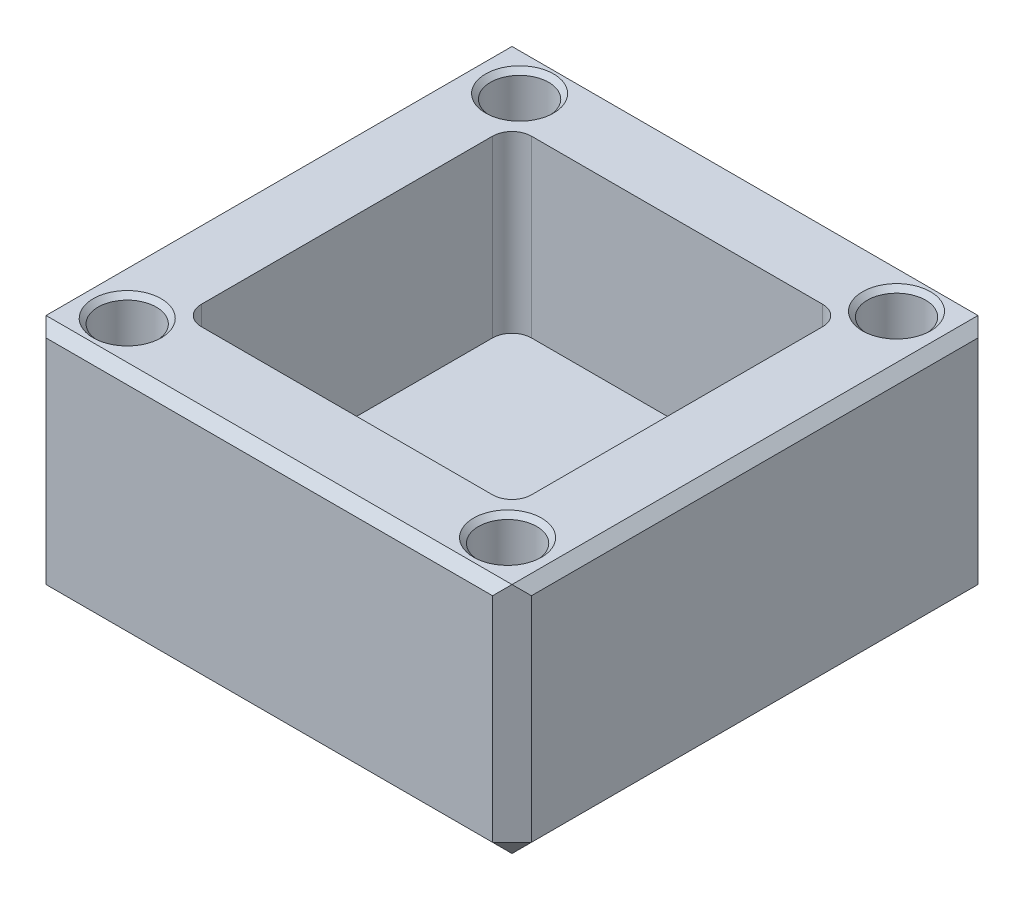
ISO-10303-21;
HEADER;
FILE_DESCRIPTION(('STEP AP214'),'2;1');
FILE_NAME('part.step','',(''),(''),'','','');
FILE_SCHEMA(('AUTOMOTIVE_DESIGN { 1 0 10303 214 1 1 1 1 }'));
ENDSEC;
DATA;
#1=APPLICATION_CONTEXT('core data for automotive mechanical design processes');
#2=APPLICATION_PROTOCOL_DEFINITION('international standard','automotive_design',2000,#1);
#3=PRODUCT_CONTEXT('',#1,'mechanical');
#4=PRODUCT('Part','Part','',(#3));
#5=PRODUCT_RELATED_PRODUCT_CATEGORY('part','',(#4));
#6=PRODUCT_DEFINITION_FORMATION('','',#4);
#7=PRODUCT_DEFINITION_CONTEXT('part definition',#1,'design');
#8=PRODUCT_DEFINITION('design','',#6,#7);
#9=PRODUCT_DEFINITION_SHAPE('','',#8);
#10=(LENGTH_UNIT() NAMED_UNIT(*) SI_UNIT(.MILLI.,.METRE.));
#11=(NAMED_UNIT(*) PLANE_ANGLE_UNIT() SI_UNIT($,.RADIAN.));
#12=(NAMED_UNIT(*) SI_UNIT($,.STERADIAN.) SOLID_ANGLE_UNIT());
#13=UNCERTAINTY_MEASURE_WITH_UNIT(LENGTH_MEASURE(1.E-05),#10,'distance_accuracy_value','');
#14=(GEOMETRIC_REPRESENTATION_CONTEXT(3) GLOBAL_UNCERTAINTY_ASSIGNED_CONTEXT((#13)) GLOBAL_UNIT_ASSIGNED_CONTEXT((#10,
#11,#12)) REPRESENTATION_CONTEXT('',''));
#15=CARTESIAN_POINT('',(0.,0.,0.));
#16=DIRECTION('',(0.,0.,1.));
#17=DIRECTION('',(1.,0.,0.));
#18=AXIS2_PLACEMENT_3D('',#15,#16,#17);
#19=CARTESIAN_POINT('',(25.,25.,-25.));
#20=DIRECTION('',(-1.,0.,0.));
#21=DIRECTION('',(0.,0.,1.));
#22=AXIS2_PLACEMENT_3D('',#19,#20,#21);
#23=PLANE('',#22);
#24=DIRECTION('',(0.,1.,0.));
#25=VECTOR('',#24,1.);
#26=CARTESIAN_POINT('',(25.,25.,-23.));
#27=LINE('',#26,#25);
#28=CARTESIAN_POINT('',(25.,2.,-23.));
#29=VERTEX_POINT('',#28);
#30=CARTESIAN_POINT('',(25.,24.,-23.));
#31=VERTEX_POINT('',#30);
#32=EDGE_CURVE('E199',#29,#31,#27,.T.);
#33=ORIENTED_EDGE('',*,*,#32,.T.);
#34=DIRECTION('',(0.,0.,1.));
#35=VECTOR('',#34,1.);
#36=CARTESIAN_POINT('',(25.,24.,23.));
#37=LINE('',#36,#35);
#38=CARTESIAN_POINT('',(25.,24.,23.));
#39=VERTEX_POINT('',#38);
#40=EDGE_CURVE('E310',#31,#39,#37,.T.);
#41=ORIENTED_EDGE('',*,*,#40,.T.);
#42=DIRECTION('',(0.,-1.,0.));
#43=VECTOR('',#42,1.);
#44=CARTESIAN_POINT('',(25.,25.,23.));
#45=LINE('',#44,#43);
#46=CARTESIAN_POINT('',(25.,2.,23.));
#47=VERTEX_POINT('',#46);
#48=EDGE_CURVE('E238',#39,#47,#45,.T.);
#49=ORIENTED_EDGE('',*,*,#48,.T.);
#50=DIRECTION('',(0.,0.,-1.));
#51=VECTOR('',#50,1.);
#52=CARTESIAN_POINT('',(25.,2.,-25.));
#53=LINE('',#52,#51);
#54=EDGE_CURVE('E240',#47,#29,#53,.T.);
#55=ORIENTED_EDGE('',*,*,#54,.T.);
#56=EDGE_LOOP('',(#33,#41,#49,#55));
#57=FACE_BOUND('',#56,.T.);
#58=ADVANCED_FACE('F40',(#57),#23,.F.);
#59=CARTESIAN_POINT('',(-25.,25.,-25.));
#60=DIRECTION('',(0.,0.,1.));
#61=DIRECTION('',(1.,0.,0.));
#62=AXIS2_PLACEMENT_3D('',#59,#60,#61);
#63=PLANE('',#62);
#64=DIRECTION('',(0.,1.,0.));
#65=VECTOR('',#64,1.);
#66=CARTESIAN_POINT('',(-23.,25.,-25.));
#67=LINE('',#66,#65);
#68=CARTESIAN_POINT('',(-23.,2.,-25.));
#69=VERTEX_POINT('',#68);
#70=CARTESIAN_POINT('',(-23.,24.,-25.));
#71=VERTEX_POINT('',#70);
#72=EDGE_CURVE('E217',#69,#71,#67,.T.);
#73=ORIENTED_EDGE('',*,*,#72,.T.);
#74=DIRECTION('',(1.,0.,0.));
#75=VECTOR('',#74,1.);
#76=CARTESIAN_POINT('',(23.,24.,-25.));
#77=LINE('',#76,#75);
#78=CARTESIAN_POINT('',(23.,24.,-25.));
#79=VERTEX_POINT('',#78);
#80=EDGE_CURVE('E187',#71,#79,#77,.T.);
#81=ORIENTED_EDGE('',*,*,#80,.T.);
#82=DIRECTION('',(0.,-1.,0.));
#83=VECTOR('',#82,1.);
#84=CARTESIAN_POINT('',(23.,25.,-25.));
#85=LINE('',#84,#83);
#86=CARTESIAN_POINT('',(23.,2.,-25.));
#87=VERTEX_POINT('',#86);
#88=EDGE_CURVE('E180',#79,#87,#85,.T.);
#89=ORIENTED_EDGE('',*,*,#88,.T.);
#90=DIRECTION('',(-1.,0.,0.));
#91=VECTOR('',#90,1.);
#92=CARTESIAN_POINT('',(-25.,2.,-25.));
#93=LINE('',#92,#91);
#94=EDGE_CURVE('E185',#87,#69,#93,.T.);
#95=ORIENTED_EDGE('',*,*,#94,.T.);
#96=EDGE_LOOP('',(#73,#81,#89,#95));
#97=FACE_BOUND('',#96,.T.);
#98=ADVANCED_FACE('F183',(#97),#63,.F.);
#99=CARTESIAN_POINT('',(-25.,25.,-25.));
#100=DIRECTION('',(1.,0.,0.));
#101=DIRECTION('',(0.,0.,-1.));
#102=AXIS2_PLACEMENT_3D('',#99,#100,#101);
#103=PLANE('',#102);
#104=DIRECTION('',(0.,1.,0.));
#105=VECTOR('',#104,1.);
#106=CARTESIAN_POINT('',(-25.,25.,23.));
#107=LINE('',#106,#105);
#108=CARTESIAN_POINT('',(-25.,2.,23.));
#109=VERTEX_POINT('',#108);
#110=CARTESIAN_POINT('',(-25.,24.,23.));
#111=VERTEX_POINT('',#110);
#112=EDGE_CURVE('E231',#109,#111,#107,.T.);
#113=ORIENTED_EDGE('',*,*,#112,.T.);
#114=DIRECTION('',(0.,0.,-1.));
#115=VECTOR('',#114,1.);
#116=CARTESIAN_POINT('',(-25.,24.,-23.));
#117=LINE('',#116,#115);
#118=CARTESIAN_POINT('',(-25.,24.,-23.));
#119=VERTEX_POINT('',#118);
#120=EDGE_CURVE('E291',#111,#119,#117,.T.);
#121=ORIENTED_EDGE('',*,*,#120,.T.);
#122=DIRECTION('',(0.,-1.,0.));
#123=VECTOR('',#122,1.);
#124=CARTESIAN_POINT('',(-25.,25.,-23.));
#125=LINE('',#124,#123);
#126=CARTESIAN_POINT('',(-25.,2.,-23.));
#127=VERTEX_POINT('',#126);
#128=EDGE_CURVE('E236',#119,#127,#125,.T.);
#129=ORIENTED_EDGE('',*,*,#128,.T.);
#130=DIRECTION('',(0.,0.,1.));
#131=VECTOR('',#130,1.);
#132=CARTESIAN_POINT('',(-25.,2.,-25.));
#133=LINE('',#132,#131);
#134=EDGE_CURVE('E234',#127,#109,#133,.T.);
#135=ORIENTED_EDGE('',*,*,#134,.T.);
#136=EDGE_LOOP('',(#113,#121,#129,#135));
#137=FACE_BOUND('',#136,.T.);
#138=ADVANCED_FACE('F388',(#137),#103,.F.);
#139=CARTESIAN_POINT('',(-25.,25.,25.));
#140=DIRECTION('',(0.,0.,-1.));
#141=DIRECTION('',(-1.,0.,0.));
#142=AXIS2_PLACEMENT_3D('',#139,#140,#141);
#143=PLANE('',#142);
#144=DIRECTION('',(0.,1.,0.));
#145=VECTOR('',#144,1.);
#146=CARTESIAN_POINT('',(23.,25.,25.));
#147=LINE('',#146,#145);
#148=CARTESIAN_POINT('',(23.,2.,25.));
#149=VERTEX_POINT('',#148);
#150=CARTESIAN_POINT('',(23.,24.,25.));
#151=VERTEX_POINT('',#150);
#152=EDGE_CURVE('E247',#149,#151,#147,.T.);
#153=ORIENTED_EDGE('',*,*,#152,.T.);
#154=DIRECTION('',(-1.,0.,0.));
#155=VECTOR('',#154,1.);
#156=CARTESIAN_POINT('',(-23.,24.,25.));
#157=LINE('',#156,#155);
#158=CARTESIAN_POINT('',(-23.,24.,25.));
#159=VERTEX_POINT('',#158);
#160=EDGE_CURVE('E308',#151,#159,#157,.T.);
#161=ORIENTED_EDGE('',*,*,#160,.T.);
#162=DIRECTION('',(0.,-1.,0.));
#163=VECTOR('',#162,1.);
#164=CARTESIAN_POINT('',(-23.,25.,25.));
#165=LINE('',#164,#163);
#166=CARTESIAN_POINT('',(-23.,2.,25.));
#167=VERTEX_POINT('',#166);
#168=EDGE_CURVE('E243',#159,#167,#165,.T.);
#169=ORIENTED_EDGE('',*,*,#168,.T.);
#170=DIRECTION('',(1.,0.,0.));
#171=VECTOR('',#170,1.);
#172=CARTESIAN_POINT('',(-25.,2.,25.));
#173=LINE('',#172,#171);
#174=EDGE_CURVE('E245',#167,#149,#173,.T.);
#175=ORIENTED_EDGE('',*,*,#174,.T.);
#176=EDGE_LOOP('',(#153,#161,#169,#175));
#177=FACE_BOUND('',#176,.T.);
#178=ADVANCED_FACE('F601',(#177),#143,.F.);
#179=CARTESIAN_POINT('',(0.,25.,0.));
#180=DIRECTION('',(0.,1.,0.));
#181=DIRECTION('',(0.,0.,1.));
#182=AXIS2_PLACEMENT_3D('',#179,#180,#181);
#183=PLANE('',#182);
#184=CARTESIAN_POINT('',(19.4340279778043,25.,-20.1741940399519));
#185=DIRECTION('',(0.,1.,0.));
#186=DIRECTION('',(0.,0.,1.));
#187=AXIS2_PLACEMENT_3D('',#184,#185,#186);
#188=CIRCLE('',#187,3.50000000000002);
#189=CARTESIAN_POINT('',(19.4340279778043,25.,-16.6741940399519));
#190=VERTEX_POINT('',#189);
#191=EDGE_CURVE('E357',#190,#190,#188,.F.);
#192=ORIENTED_EDGE('',*,*,#191,.T.);
#193=EDGE_LOOP('',(#192));
#194=FACE_BOUND('',#193,.T.);
#195=CARTESIAN_POINT('',(-19.4101736363355,25.,-20.1923444429938));
#196=DIRECTION('',(0.,1.,0.));
#197=DIRECTION('',(0.,0.,1.));
#198=AXIS2_PLACEMENT_3D('',#195,#196,#197);
#199=CIRCLE('',#198,3.50000000000002);
#200=CARTESIAN_POINT('',(-19.4101736363355,25.,-16.6923444429938));
#201=VERTEX_POINT('',#200);
#202=EDGE_CURVE('E354',#201,#201,#199,.F.);
#203=ORIENTED_EDGE('',*,*,#202,.T.);
#204=EDGE_LOOP('',(#203));
#205=FACE_BOUND('',#204,.T.);
#206=CARTESIAN_POINT('',(-19.5684293991816,25.,20.0664589384859));
#207=DIRECTION('',(0.,1.,0.));
#208=DIRECTION('',(0.,0.,1.));
#209=AXIS2_PLACEMENT_3D('',#206,#207,#208);
#210=CIRCLE('',#209,3.50000000000002);
#211=CARTESIAN_POINT('',(-19.5684293991816,25.,23.5664589384859));
#212=VERTEX_POINT('',#211);
#213=EDGE_CURVE('E351',#212,#212,#210,.F.);
#214=ORIENTED_EDGE('',*,*,#213,.T.);
#215=EDGE_LOOP('',(#214));
#216=FACE_BOUND('',#215,.T.);
#217=CARTESIAN_POINT('',(19.5918577536134,25.,20.046682357095));
#218=DIRECTION('',(0.,1.,0.));
#219=DIRECTION('',(0.,0.,1.));
#220=AXIS2_PLACEMENT_3D('',#217,#218,#219);
#221=CIRCLE('',#220,3.50000000000002);
#222=CARTESIAN_POINT('',(19.5918577536134,25.,23.5466823570951));
#223=VERTEX_POINT('',#222);
#224=EDGE_CURVE('E348',#223,#223,#221,.F.);
#225=ORIENTED_EDGE('',*,*,#224,.T.);
#226=EDGE_LOOP('',(#225));
#227=FACE_BOUND('',#226,.T.);
#228=DIRECTION('',(1.,0.,0.));
#229=VECTOR('',#228,1.);
#230=CARTESIAN_POINT('',(-17.,25.,17.));
#231=LINE('',#230,#229);
#232=CARTESIAN_POINT('',(-15.,25.,17.));
#233=VERTEX_POINT('',#232);
#234=CARTESIAN_POINT('',(15.,25.,17.));
#235=VERTEX_POINT('',#234);
#236=EDGE_CURVE('E563',#233,#235,#231,.T.);
#237=ORIENTED_EDGE('',*,*,#236,.F.);
#238=CARTESIAN_POINT('',(-15.,25.,15.));
#239=DIRECTION('',(0.,1.,0.));
#240=DIRECTION('',(0.,0.,1.));
#241=AXIS2_PLACEMENT_3D('',#238,#239,#240);
#242=CIRCLE('',#241,2.);
#243=CARTESIAN_POINT('',(-17.,25.,15.));
#244=VERTEX_POINT('',#243);
#245=EDGE_CURVE('E339',#233,#244,#242,.F.);
#246=ORIENTED_EDGE('',*,*,#245,.T.);
#247=DIRECTION('',(0.,0.,1.));
#248=VECTOR('',#247,1.);
#249=CARTESIAN_POINT('',(-17.,25.,-17.));
#250=LINE('',#249,#248);
#251=CARTESIAN_POINT('',(-17.,25.,-15.));
#252=VERTEX_POINT('',#251);
#253=EDGE_CURVE('E555',#252,#244,#250,.T.);
#254=ORIENTED_EDGE('',*,*,#253,.F.);
#255=CARTESIAN_POINT('',(-15.,25.,-15.));
#256=DIRECTION('',(0.,1.,0.));
#257=DIRECTION('',(0.,0.,1.));
#258=AXIS2_PLACEMENT_3D('',#255,#256,#257);
#259=CIRCLE('',#258,2.);
#260=CARTESIAN_POINT('',(-15.,25.,-17.));
#261=VERTEX_POINT('',#260);
#262=EDGE_CURVE('E64',#252,#261,#259,.F.);
#263=ORIENTED_EDGE('',*,*,#262,.T.);
#264=DIRECTION('',(1.,0.,0.));
#265=VECTOR('',#264,1.);
#266=CARTESIAN_POINT('',(-17.,25.,-17.));
#267=LINE('',#266,#265);
#268=CARTESIAN_POINT('',(15.,25.,-17.));
#269=VERTEX_POINT('',#268);
#270=EDGE_CURVE('E569',#261,#269,#267,.T.);
#271=ORIENTED_EDGE('',*,*,#270,.T.);
#272=CARTESIAN_POINT('',(15.,25.,-15.));
#273=DIRECTION('',(0.,1.,0.));
#274=DIRECTION('',(0.,0.,1.));
#275=AXIS2_PLACEMENT_3D('',#272,#273,#274);
#276=CIRCLE('',#275,2.);
#277=CARTESIAN_POINT('',(17.,25.,-15.));
#278=VERTEX_POINT('',#277);
#279=EDGE_CURVE('E56',#269,#278,#276,.F.);
#280=ORIENTED_EDGE('',*,*,#279,.T.);
#281=DIRECTION('',(0.,0.,1.));
#282=VECTOR('',#281,1.);
#283=CARTESIAN_POINT('',(17.,25.,-17.));
#284=LINE('',#283,#282);
#285=CARTESIAN_POINT('',(17.,25.,15.));
#286=VERTEX_POINT('',#285);
#287=EDGE_CURVE('E566',#278,#286,#284,.T.);
#288=ORIENTED_EDGE('',*,*,#287,.T.);
#289=CARTESIAN_POINT('',(15.,25.,15.));
#290=DIRECTION('',(0.,1.,0.));
#291=DIRECTION('',(0.,0.,1.));
#292=AXIS2_PLACEMENT_3D('',#289,#290,#291);
#293=CIRCLE('',#292,2.);
#294=EDGE_CURVE('E341',#286,#235,#293,.F.);
#295=ORIENTED_EDGE('',*,*,#294,.T.);
#296=EDGE_LOOP('',(#237,#246,#254,#263,#271,#280,#288,#295));
#297=FACE_BOUND('',#296,.T.);
#298=DIRECTION('',(-1.,0.,0.));
#299=VECTOR('',#298,1.);
#300=CARTESIAN_POINT('',(-23.,25.,-24.));
#301=LINE('',#300,#299);
#302=CARTESIAN_POINT('',(24.,25.,-24.));
#303=VERTEX_POINT('',#302);
#304=CARTESIAN_POINT('',(-24.,25.,-24.));
#305=VERTEX_POINT('',#304);
#306=EDGE_CURVE('E280',#303,#305,#301,.T.);
#307=ORIENTED_EDGE('',*,*,#306,.T.);
#308=DIRECTION('',(0.,0.,1.));
#309=VECTOR('',#308,1.);
#310=CARTESIAN_POINT('',(-24.,25.,23.));
#311=LINE('',#310,#309);
#312=CARTESIAN_POINT('',(-24.,25.,24.));
#313=VERTEX_POINT('',#312);
#314=EDGE_CURVE('E283',#305,#313,#311,.T.);
#315=ORIENTED_EDGE('',*,*,#314,.T.);
#316=DIRECTION('',(1.,0.,0.));
#317=VECTOR('',#316,1.);
#318=CARTESIAN_POINT('',(23.,25.,24.));
#319=LINE('',#318,#317);
#320=CARTESIAN_POINT('',(24.,25.,24.));
#321=VERTEX_POINT('',#320);
#322=EDGE_CURVE('E277',#313,#321,#319,.T.);
#323=ORIENTED_EDGE('',*,*,#322,.T.);
#324=DIRECTION('',(0.,0.,-1.));
#325=VECTOR('',#324,1.);
#326=CARTESIAN_POINT('',(24.,25.,-23.));
#327=LINE('',#326,#325);
#328=EDGE_CURVE('E250',#321,#303,#327,.T.);
#329=ORIENTED_EDGE('',*,*,#328,.T.);
#330=EDGE_LOOP('',(#307,#315,#323,#329));
#331=FACE_BOUND('',#330,.T.);
#332=ADVANCED_FACE('F597',(#194,#205,#216,#227,#297,#331),#183,.T.);
#333=CARTESIAN_POINT('',(0.,0.,0.));
#334=DIRECTION('',(0.,1.,0.));
#335=DIRECTION('',(0.,0.,1.));
#336=AXIS2_PLACEMENT_3D('',#333,#334,#335);
#337=PLANE('',#336);
#338=DIRECTION('',(0.,0.,-1.));
#339=VECTOR('',#338,1.);
#340=CARTESIAN_POINT('',(-23.,0.,0.));
#341=LINE('',#340,#339);
#342=CARTESIAN_POINT('',(-23.,0.,23.));
#343=VERTEX_POINT('',#342);
#344=CARTESIAN_POINT('',(-23.,0.,-23.));
#345=VERTEX_POINT('',#344);
#346=EDGE_CURVE('E226',#343,#345,#341,.T.);
#347=ORIENTED_EDGE('',*,*,#346,.T.);
#348=DIRECTION('',(1.,0.,0.));
#349=VECTOR('',#348,1.);
#350=CARTESIAN_POINT('',(0.,0.,-23.));
#351=LINE('',#350,#349);
#352=CARTESIAN_POINT('',(23.,0.,-23.));
#353=VERTEX_POINT('',#352);
#354=EDGE_CURVE('E228',#345,#353,#351,.T.);
#355=ORIENTED_EDGE('',*,*,#354,.T.);
#356=DIRECTION('',(0.,0.,1.));
#357=VECTOR('',#356,1.);
#358=CARTESIAN_POINT('',(23.,0.,0.));
#359=LINE('',#358,#357);
#360=CARTESIAN_POINT('',(23.,0.,23.));
#361=VERTEX_POINT('',#360);
#362=EDGE_CURVE('E224',#353,#361,#359,.T.);
#363=ORIENTED_EDGE('',*,*,#362,.T.);
#364=DIRECTION('',(-1.,0.,0.));
#365=VECTOR('',#364,1.);
#366=CARTESIAN_POINT('',(0.,0.,23.));
#367=LINE('',#366,#365);
#368=EDGE_CURVE('E219',#361,#343,#367,.T.);
#369=ORIENTED_EDGE('',*,*,#368,.T.);
#370=EDGE_LOOP('',(#347,#355,#363,#369));
#371=FACE_BOUND('',#370,.T.);
#372=ADVANCED_FACE('F600',(#371),#337,.F.);
#373=CARTESIAN_POINT('',(-17.,7.,17.));
#374=DIRECTION('',(0.,0.,1.));
#375=DIRECTION('',(1.,0.,0.));
#376=AXIS2_PLACEMENT_3D('',#373,#374,#375);
#377=PLANE('',#376);
#378=DIRECTION('',(1.,0.,0.));
#379=VECTOR('',#378,1.);
#380=CARTESIAN_POINT('',(-17.,7.,17.));
#381=LINE('',#380,#379);
#382=CARTESIAN_POINT('',(-15.,7.,17.));
#383=VERTEX_POINT('',#382);
#384=CARTESIAN_POINT('',(15.,7.,17.));
#385=VERTEX_POINT('',#384);
#386=EDGE_CURVE('E551',#383,#385,#381,.T.);
#387=ORIENTED_EDGE('',*,*,#386,.F.);
#388=DIRECTION('',(0.,1.,0.));
#389=VECTOR('',#388,1.);
#390=CARTESIAN_POINT('',(-15.,25.,17.));
#391=LINE('',#390,#389);
#392=EDGE_CURVE('E314',#383,#233,#391,.T.);
#393=ORIENTED_EDGE('',*,*,#392,.T.);
#394=ORIENTED_EDGE('',*,*,#236,.T.);
#395=DIRECTION('',(0.,1.,0.));
#396=VECTOR('',#395,1.);
#397=CARTESIAN_POINT('',(15.,7.,17.));
#398=LINE('',#397,#396);
#399=EDGE_CURVE('E312',#235,#385,#398,.F.);
#400=ORIENTED_EDGE('',*,*,#399,.T.);
#401=EDGE_LOOP('',(#387,#393,#394,#400));
#402=FACE_BOUND('',#401,.T.);
#403=ADVANCED_FACE('F583',(#402),#377,.F.);
#404=CARTESIAN_POINT('',(-17.,7.,-17.));
#405=DIRECTION('',(-1.,0.,0.));
#406=DIRECTION('',(0.,0.,1.));
#407=AXIS2_PLACEMENT_3D('',#404,#405,#406);
#408=PLANE('',#407);
#409=ORIENTED_EDGE('',*,*,#253,.T.);
#410=DIRECTION('',(0.,1.,0.));
#411=VECTOR('',#410,1.);
#412=CARTESIAN_POINT('',(-17.,7.,15.));
#413=LINE('',#412,#411);
#414=CARTESIAN_POINT('',(-17.,7.,15.));
#415=VERTEX_POINT('',#414);
#416=EDGE_CURVE('E320',#244,#415,#413,.F.);
#417=ORIENTED_EDGE('',*,*,#416,.T.);
#418=DIRECTION('',(0.,0.,1.));
#419=VECTOR('',#418,1.);
#420=CARTESIAN_POINT('',(-17.,7.,-17.));
#421=LINE('',#420,#419);
#422=CARTESIAN_POINT('',(-17.,7.,-15.));
#423=VERTEX_POINT('',#422);
#424=EDGE_CURVE('E191',#423,#415,#421,.T.);
#425=ORIENTED_EDGE('',*,*,#424,.F.);
#426=DIRECTION('',(0.,1.,0.));
#427=VECTOR('',#426,1.);
#428=CARTESIAN_POINT('',(-17.,7.,-15.));
#429=LINE('',#428,#427);
#430=EDGE_CURVE('E317',#423,#252,#429,.T.);
#431=ORIENTED_EDGE('',*,*,#430,.T.);
#432=EDGE_LOOP('',(#409,#417,#425,#431));
#433=FACE_BOUND('',#432,.T.);
#434=ADVANCED_FACE('F573',(#433),#408,.F.);
#435=CARTESIAN_POINT('',(-17.,7.,-17.));
#436=DIRECTION('',(0.,0.,1.));
#437=DIRECTION('',(1.,0.,0.));
#438=AXIS2_PLACEMENT_3D('',#435,#436,#437);
#439=PLANE('',#438);
#440=DIRECTION('',(1.,0.,0.));
#441=VECTOR('',#440,1.);
#442=CARTESIAN_POINT('',(-17.,7.,-17.));
#443=LINE('',#442,#441);
#444=CARTESIAN_POINT('',(-15.,7.,-17.));
#445=VERTEX_POINT('',#444);
#446=CARTESIAN_POINT('',(15.,7.,-17.));
#447=VERTEX_POINT('',#446);
#448=EDGE_CURVE('E558',#445,#447,#443,.T.);
#449=ORIENTED_EDGE('',*,*,#448,.T.);
#450=DIRECTION('',(0.,1.,0.));
#451=VECTOR('',#450,1.);
#452=CARTESIAN_POINT('',(15.,25.,-17.));
#453=LINE('',#452,#451);
#454=EDGE_CURVE('E337',#447,#269,#453,.T.);
#455=ORIENTED_EDGE('',*,*,#454,.T.);
#456=ORIENTED_EDGE('',*,*,#270,.F.);
#457=DIRECTION('',(0.,1.,0.));
#458=VECTOR('',#457,1.);
#459=CARTESIAN_POINT('',(-15.,7.,-17.));
#460=LINE('',#459,#458);
#461=EDGE_CURVE('E335',#261,#445,#460,.F.);
#462=ORIENTED_EDGE('',*,*,#461,.T.);
#463=EDGE_LOOP('',(#449,#455,#456,#462));
#464=FACE_BOUND('',#463,.T.);
#465=ADVANCED_FACE('F595',(#464),#439,.T.);
#466=CARTESIAN_POINT('',(17.,7.,-17.));
#467=DIRECTION('',(-1.,0.,0.));
#468=DIRECTION('',(0.,0.,1.));
#469=AXIS2_PLACEMENT_3D('',#466,#467,#468);
#470=PLANE('',#469);
#471=DIRECTION('',(0.,0.,1.));
#472=VECTOR('',#471,1.);
#473=CARTESIAN_POINT('',(17.,7.,-17.));
#474=LINE('',#473,#472);
#475=CARTESIAN_POINT('',(17.,7.,-15.));
#476=VERTEX_POINT('',#475);
#477=CARTESIAN_POINT('',(17.,7.,15.));
#478=VERTEX_POINT('',#477);
#479=EDGE_CURVE('E554',#476,#478,#474,.T.);
#480=ORIENTED_EDGE('',*,*,#479,.T.);
#481=DIRECTION('',(0.,1.,0.));
#482=VECTOR('',#481,1.);
#483=CARTESIAN_POINT('',(17.,7.,15.));
#484=LINE('',#483,#482);
#485=EDGE_CURVE('E332',#478,#286,#484,.T.);
#486=ORIENTED_EDGE('',*,*,#485,.T.);
#487=ORIENTED_EDGE('',*,*,#287,.F.);
#488=DIRECTION('',(0.,1.,0.));
#489=VECTOR('',#488,1.);
#490=CARTESIAN_POINT('',(17.,7.,-15.));
#491=LINE('',#490,#489);
#492=EDGE_CURVE('E330',#278,#476,#491,.F.);
#493=ORIENTED_EDGE('',*,*,#492,.T.);
#494=EDGE_LOOP('',(#480,#486,#487,#493));
#495=FACE_BOUND('',#494,.T.);
#496=ADVANCED_FACE('F590',(#495),#470,.T.);
#497=CARTESIAN_POINT('',(0.,7.,0.));
#498=DIRECTION('',(0.,-1.,0.));
#499=DIRECTION('',(0.,0.,-1.));
#500=AXIS2_PLACEMENT_3D('',#497,#498,#499);
#501=PLANE('',#500);
#502=ORIENTED_EDGE('',*,*,#424,.T.);
#503=CARTESIAN_POINT('',(-15.,7.,15.));
#504=DIRECTION('',(0.,-1.,0.));
#505=DIRECTION('',(0.,0.,-1.));
#506=AXIS2_PLACEMENT_3D('',#503,#504,#505);
#507=CIRCLE('',#506,2.);
#508=EDGE_CURVE('E328',#415,#383,#507,.F.);
#509=ORIENTED_EDGE('',*,*,#508,.T.);
#510=ORIENTED_EDGE('',*,*,#386,.T.);
#511=CARTESIAN_POINT('',(15.,7.,15.));
#512=DIRECTION('',(0.,-1.,0.));
#513=DIRECTION('',(0.,0.,-1.));
#514=AXIS2_PLACEMENT_3D('',#511,#512,#513);
#515=CIRCLE('',#514,2.);
#516=EDGE_CURVE('E326',#385,#478,#515,.F.);
#517=ORIENTED_EDGE('',*,*,#516,.T.);
#518=ORIENTED_EDGE('',*,*,#479,.F.);
#519=CARTESIAN_POINT('',(15.,7.,-15.));
#520=DIRECTION('',(0.,-1.,0.));
#521=DIRECTION('',(0.,0.,-1.));
#522=AXIS2_PLACEMENT_3D('',#519,#520,#521);
#523=CIRCLE('',#522,2.);
#524=EDGE_CURVE('E324',#476,#447,#523,.F.);
#525=ORIENTED_EDGE('',*,*,#524,.T.);
#526=ORIENTED_EDGE('',*,*,#448,.F.);
#527=CARTESIAN_POINT('',(-15.,7.,-15.));
#528=DIRECTION('',(0.,-1.,0.));
#529=DIRECTION('',(0.,0.,-1.));
#530=AXIS2_PLACEMENT_3D('',#527,#528,#529);
#531=CIRCLE('',#530,2.);
#532=EDGE_CURVE('E322',#445,#423,#531,.F.);
#533=ORIENTED_EDGE('',*,*,#532,.T.);
#534=EDGE_LOOP('',(#502,#509,#510,#517,#518,#525,#526,#533));
#535=FACE_BOUND('',#534,.T.);
#536=ADVANCED_FACE('F580',(#535),#501,.F.);
#537=CARTESIAN_POINT('',(-19.5684293991816,7.,20.0664589384859));
#538=DIRECTION('',(0.,1.,0.));
#539=DIRECTION('',(0.,0.,1.));
#540=AXIS2_PLACEMENT_3D('',#537,#538,#539);
#541=CYLINDRICAL_SURFACE('',#540,3.);
#542=CARTESIAN_POINT('',(-19.5684293991816,24.5,20.0664589384859));
#543=DIRECTION('',(0.,1.,0.));
#544=DIRECTION('',(0.,0.,1.));
#545=AXIS2_PLACEMENT_3D('',#542,#543,#544);
#546=CIRCLE('',#545,3.);
#547=CARTESIAN_POINT('',(-19.5684293991816,24.5,23.0664589384859));
#548=VERTEX_POINT('',#547);
#549=EDGE_CURVE('E49',#548,#548,#546,.T.);
#550=ORIENTED_EDGE('',*,*,#549,.T.);
#551=EDGE_LOOP('',(#550));
#552=FACE_BOUND('',#551,.T.);
#553=CARTESIAN_POINT('',(-19.5684293991816,7.,20.0664589384859));
#554=DIRECTION('',(0.,1.,0.));
#555=DIRECTION('',(0.,0.,1.));
#556=AXIS2_PLACEMENT_3D('',#553,#554,#555);
#557=CIRCLE('',#556,3.);
#558=CARTESIAN_POINT('',(-19.5684293991816,7.,23.0664589384859));
#559=VERTEX_POINT('',#558);
#560=EDGE_CURVE('E545',#559,#559,#557,.T.);
#561=ORIENTED_EDGE('',*,*,#560,.F.);
#562=EDGE_LOOP('',(#561));
#563=FACE_BOUND('',#562,.T.);
#564=ADVANCED_FACE('F365',(#552,#563),#541,.F.);
#565=CARTESIAN_POINT('',(-19.5684293991816,7.,20.0664589384859));
#566=DIRECTION('',(0.,1.,0.));
#567=DIRECTION('',(0.,0.,1.));
#568=AXIS2_PLACEMENT_3D('',#565,#566,#567);
#569=PLANE('',#568);
#570=ORIENTED_EDGE('',*,*,#560,.T.);
#571=EDGE_LOOP('',(#570));
#572=FACE_BOUND('',#571,.T.);
#573=ADVANCED_FACE('F673',(#572),#569,.T.);
#574=CARTESIAN_POINT('',(-19.4101736363355,7.,-20.1923444429938));
#575=DIRECTION('',(0.,1.,0.));
#576=DIRECTION('',(0.,0.,1.));
#577=AXIS2_PLACEMENT_3D('',#574,#575,#576);
#578=CYLINDRICAL_SURFACE('',#577,3.);
#579=CARTESIAN_POINT('',(-19.4101736363355,24.5,-20.1923444429938));
#580=DIRECTION('',(0.,1.,0.));
#581=DIRECTION('',(0.,0.,1.));
#582=AXIS2_PLACEMENT_3D('',#579,#580,#581);
#583=CIRCLE('',#582,3.);
#584=CARTESIAN_POINT('',(-19.4101736363355,24.5,-17.1923444429938));
#585=VERTEX_POINT('',#584);
#586=EDGE_CURVE('E360',#585,#585,#583,.T.);
#587=ORIENTED_EDGE('',*,*,#586,.T.);
#588=EDGE_LOOP('',(#587));
#589=FACE_BOUND('',#588,.T.);
#590=CARTESIAN_POINT('',(-19.4101736363355,7.,-20.1923444429938));
#591=DIRECTION('',(0.,1.,0.));
#592=DIRECTION('',(0.,0.,1.));
#593=AXIS2_PLACEMENT_3D('',#590,#591,#592);
#594=CIRCLE('',#593,3.);
#595=CARTESIAN_POINT('',(-19.4101736363355,7.,-17.1923444429938));
#596=VERTEX_POINT('',#595);
#597=EDGE_CURVE('E542',#596,#596,#594,.T.);
#598=ORIENTED_EDGE('',*,*,#597,.F.);
#599=EDGE_LOOP('',(#598));
#600=FACE_BOUND('',#599,.T.);
#601=ADVANCED_FACE('F683',(#589,#600),#578,.F.);
#602=CARTESIAN_POINT('',(-19.4101736363355,7.,-20.1923444429938));
#603=DIRECTION('',(0.,1.,0.));
#604=DIRECTION('',(0.,0.,1.));
#605=AXIS2_PLACEMENT_3D('',#602,#603,#604);
#606=PLANE('',#605);
#607=ORIENTED_EDGE('',*,*,#597,.T.);
#608=EDGE_LOOP('',(#607));
#609=FACE_BOUND('',#608,.T.);
#610=ADVANCED_FACE('F536',(#609),#606,.T.);
#611=CARTESIAN_POINT('',(19.4340279778043,7.,-20.1741940399519));
#612=DIRECTION('',(0.,1.,0.));
#613=DIRECTION('',(0.,0.,1.));
#614=AXIS2_PLACEMENT_3D('',#611,#612,#613);
#615=CYLINDRICAL_SURFACE('',#614,3.);
#616=CARTESIAN_POINT('',(19.4340279778043,24.5,-20.1741940399519));
#617=DIRECTION('',(0.,1.,0.));
#618=DIRECTION('',(0.,0.,1.));
#619=AXIS2_PLACEMENT_3D('',#616,#617,#618);
#620=CIRCLE('',#619,3.);
#621=CARTESIAN_POINT('',(19.4340279778043,24.5,-17.1741940399519));
#622=VERTEX_POINT('',#621);
#623=EDGE_CURVE('E345',#622,#622,#620,.T.);
#624=ORIENTED_EDGE('',*,*,#623,.T.);
#625=EDGE_LOOP('',(#624));
#626=FACE_BOUND('',#625,.T.);
#627=CARTESIAN_POINT('',(19.4340279778043,7.,-20.1741940399519));
#628=DIRECTION('',(0.,1.,0.));
#629=DIRECTION('',(0.,0.,1.));
#630=AXIS2_PLACEMENT_3D('',#627,#628,#629);
#631=CIRCLE('',#630,3.);
#632=CARTESIAN_POINT('',(19.4340279778043,7.,-17.1741940399519));
#633=VERTEX_POINT('',#632);
#634=EDGE_CURVE('E540',#633,#633,#631,.T.);
#635=ORIENTED_EDGE('',*,*,#634,.F.);
#636=EDGE_LOOP('',(#635));
#637=FACE_BOUND('',#636,.T.);
#638=ADVANCED_FACE('F532',(#626,#637),#615,.F.);
#639=CARTESIAN_POINT('',(19.4340279778043,7.,-20.1741940399519));
#640=DIRECTION('',(0.,1.,0.));
#641=DIRECTION('',(0.,0.,1.));
#642=AXIS2_PLACEMENT_3D('',#639,#640,#641);
#643=PLANE('',#642);
#644=ORIENTED_EDGE('',*,*,#634,.T.);
#645=EDGE_LOOP('',(#644));
#646=FACE_BOUND('',#645,.T.);
#647=ADVANCED_FACE('F535',(#646),#643,.T.);
#648=CARTESIAN_POINT('',(19.5918577536134,7.,20.046682357095));
#649=DIRECTION('',(0.,1.,0.));
#650=DIRECTION('',(0.,0.,1.));
#651=AXIS2_PLACEMENT_3D('',#648,#649,#650);
#652=CYLINDRICAL_SURFACE('',#651,3.);
#653=CARTESIAN_POINT('',(19.5918577536134,24.5,20.046682357095));
#654=DIRECTION('',(0.,1.,0.));
#655=DIRECTION('',(0.,0.,1.));
#656=AXIS2_PLACEMENT_3D('',#653,#654,#655);
#657=CIRCLE('',#656,3.);
#658=CARTESIAN_POINT('',(19.5918577536134,24.5,23.046682357095));
#659=VERTEX_POINT('',#658);
#660=EDGE_CURVE('E11',#659,#659,#657,.T.);
#661=ORIENTED_EDGE('',*,*,#660,.T.);
#662=EDGE_LOOP('',(#661));
#663=FACE_BOUND('',#662,.T.);
#664=CARTESIAN_POINT('',(19.5918577536134,7.,20.046682357095));
#665=DIRECTION('',(0.,1.,0.));
#666=DIRECTION('',(0.,0.,1.));
#667=AXIS2_PLACEMENT_3D('',#664,#665,#666);
#668=CIRCLE('',#667,3.);
#669=CARTESIAN_POINT('',(19.5918577536134,7.,23.046682357095));
#670=VERTEX_POINT('',#669);
#671=EDGE_CURVE('E274',#670,#670,#668,.T.);
#672=ORIENTED_EDGE('',*,*,#671,.F.);
#673=EDGE_LOOP('',(#672));
#674=FACE_BOUND('',#673,.T.);
#675=ADVANCED_FACE('F705',(#663,#674),#652,.F.);
#676=CARTESIAN_POINT('',(19.5918577536134,7.,20.046682357095));
#677=DIRECTION('',(0.,1.,0.));
#678=DIRECTION('',(0.,0.,1.));
#679=AXIS2_PLACEMENT_3D('',#676,#677,#678);
#680=PLANE('',#679);
#681=ORIENTED_EDGE('',*,*,#671,.T.);
#682=EDGE_LOOP('',(#681));
#683=FACE_BOUND('',#682,.T.);
#684=ADVANCED_FACE('F471',(#683),#680,.T.);
#685=CARTESIAN_POINT('',(25.,25.,23.));
#686=DIRECTION('',(-0.707106781186547,0.,-0.707106781186547));
#687=DIRECTION('',(0.,-1.,0.));
#688=AXIS2_PLACEMENT_3D('',#685,#686,#687);
#689=PLANE('',#688);
#690=DIRECTION('',(0.577350269189626,-0.577350269189626,-0.577350269189626));
#691=VECTOR('',#690,1.);
#692=CARTESIAN_POINT('',(24.6666666666667,24.3333333333333,23.3333333333333));
#693=LINE('',#692,#691);
#694=EDGE_CURVE('E303',#39,#321,#693,.F.);
#695=ORIENTED_EDGE('',*,*,#694,.T.);
#696=DIRECTION('',(0.577350269189626,0.577350269189626,-0.577350269189626));
#697=VECTOR('',#696,1.);
#698=CARTESIAN_POINT('',(24.6666666666667,25.6666666666667,23.3333333333333));
#699=LINE('',#698,#697);
#700=EDGE_CURVE('E306',#321,#151,#699,.F.);
#701=ORIENTED_EDGE('',*,*,#700,.T.);
#702=ORIENTED_EDGE('',*,*,#152,.F.);
#703=DIRECTION('',(0.707106781186547,0.,-0.707106781186547));
#704=VECTOR('',#703,1.);
#705=CARTESIAN_POINT('',(24.,2.,24.));
#706=LINE('',#705,#704);
#707=EDGE_CURVE('E268',#47,#149,#706,.F.);
#708=ORIENTED_EDGE('',*,*,#707,.F.);
#709=ORIENTED_EDGE('',*,*,#48,.F.);
#710=EDGE_LOOP('',(#695,#701,#702,#708,#709));
#711=FACE_BOUND('',#710,.T.);
#712=ADVANCED_FACE('F465',(#711),#689,.F.);
#713=CARTESIAN_POINT('',(-23.,25.,25.));
#714=DIRECTION('',(0.707106781186547,0.,-0.707106781186547));
#715=DIRECTION('',(0.,-1.,0.));
#716=AXIS2_PLACEMENT_3D('',#713,#714,#715);
#717=PLANE('',#716);
#718=DIRECTION('',(0.577350269189626,-0.577350269189626,0.577350269189626));
#719=VECTOR('',#718,1.);
#720=CARTESIAN_POINT('',(-23.3333333333333,24.3333333333333,24.6666666666667));
#721=LINE('',#720,#719);
#722=EDGE_CURVE('E286',#159,#313,#721,.F.);
#723=ORIENTED_EDGE('',*,*,#722,.T.);
#724=DIRECTION('',(0.577350269189626,0.577350269189626,0.577350269189626));
#725=VECTOR('',#724,1.);
#726=CARTESIAN_POINT('',(-23.3333333333333,25.6666666666667,24.6666666666667));
#727=LINE('',#726,#725);
#728=EDGE_CURVE('E289',#313,#111,#727,.F.);
#729=ORIENTED_EDGE('',*,*,#728,.T.);
#730=ORIENTED_EDGE('',*,*,#112,.F.);
#731=DIRECTION('',(0.707106781186547,0.,0.707106781186547));
#732=VECTOR('',#731,1.);
#733=CARTESIAN_POINT('',(-25.,2.,23.));
#734=LINE('',#733,#732);
#735=EDGE_CURVE('E265',#167,#109,#734,.F.);
#736=ORIENTED_EDGE('',*,*,#735,.F.);
#737=ORIENTED_EDGE('',*,*,#168,.F.);
#738=EDGE_LOOP('',(#723,#729,#730,#736,#737));
#739=FACE_BOUND('',#738,.T.);
#740=ADVANCED_FACE('F458',(#739),#717,.F.);
#741=CARTESIAN_POINT('',(-25.,2.,25.));
#742=DIRECTION('',(0.,0.707106781186547,-0.707106781186547));
#743=DIRECTION('',(1.,0.,0.));
#744=AXIS2_PLACEMENT_3D('',#741,#742,#743);
#745=PLANE('',#744);
#746=DIRECTION('',(0.,0.707106781186547,0.707106781186547));
#747=VECTOR('',#746,1.);
#748=CARTESIAN_POINT('',(23.,0.,23.));
#749=LINE('',#748,#747);
#750=EDGE_CURVE('E271',#149,#361,#749,.F.);
#751=ORIENTED_EDGE('',*,*,#750,.F.);
#752=ORIENTED_EDGE('',*,*,#174,.F.);
#753=DIRECTION('',(0.,-0.707106781186547,-0.707106781186547));
#754=VECTOR('',#753,1.);
#755=CARTESIAN_POINT('',(-23.,1.,24.));
#756=LINE('',#755,#754);
#757=EDGE_CURVE('E262',#343,#167,#756,.F.);
#758=ORIENTED_EDGE('',*,*,#757,.F.);
#759=ORIENTED_EDGE('',*,*,#368,.F.);
#760=EDGE_LOOP('',(#751,#752,#758,#759));
#761=FACE_BOUND('',#760,.T.);
#762=ADVANCED_FACE('F451',(#761),#745,.F.);
#763=CARTESIAN_POINT('',(23.,0.,23.));
#764=DIRECTION('',(0.577350269189626,-0.577350269189626,0.577350269189626));
#765=DIRECTION('',(0.707106781186547,0.,-0.707106781186547));
#766=AXIS2_PLACEMENT_3D('',#763,#764,#765);
#767=PLANE('',#766);
#768=ORIENTED_EDGE('',*,*,#707,.T.);
#769=ORIENTED_EDGE('',*,*,#750,.T.);
#770=DIRECTION('',(-0.707106781186548,-0.707106781186548,0.));
#771=VECTOR('',#770,1.);
#772=CARTESIAN_POINT('',(23.,0.,23.));
#773=LINE('',#772,#771);
#774=EDGE_CURVE('E259',#47,#361,#773,.T.);
#775=ORIENTED_EDGE('',*,*,#774,.F.);
#776=EDGE_LOOP('',(#768,#769,#775));
#777=FACE_BOUND('',#776,.T.);
#778=ADVANCED_FACE('F444',(#777),#767,.T.);
#779=CARTESIAN_POINT('',(-25.,2.,23.));
#780=DIRECTION('',(-0.577350269189626,-0.577350269189626,0.577350269189626));
#781=DIRECTION('',(0.707106781186547,0.,0.707106781186547));
#782=AXIS2_PLACEMENT_3D('',#779,#780,#781);
#783=PLANE('',#782);
#784=ORIENTED_EDGE('',*,*,#757,.T.);
#785=ORIENTED_EDGE('',*,*,#735,.T.);
#786=DIRECTION('',(-0.707106781186547,0.707106781186547,0.));
#787=VECTOR('',#786,1.);
#788=CARTESIAN_POINT('',(-25.,2.,23.));
#789=LINE('',#788,#787);
#790=EDGE_CURVE('E256',#343,#109,#789,.T.);
#791=ORIENTED_EDGE('',*,*,#790,.F.);
#792=EDGE_LOOP('',(#784,#785,#791));
#793=FACE_BOUND('',#792,.T.);
#794=ADVANCED_FACE('F437',(#793),#783,.T.);
#795=CARTESIAN_POINT('',(25.,2.,-25.));
#796=DIRECTION('',(-0.707106781186547,0.707106781186547,0.));
#797=DIRECTION('',(0.,0.,-1.));
#798=AXIS2_PLACEMENT_3D('',#795,#796,#797);
#799=PLANE('',#798);
#800=ORIENTED_EDGE('',*,*,#774,.T.);
#801=ORIENTED_EDGE('',*,*,#362,.F.);
#802=DIRECTION('',(0.707106781186547,0.707106781186547,0.));
#803=VECTOR('',#802,1.);
#804=CARTESIAN_POINT('',(23.,0.,-23.));
#805=LINE('',#804,#803);
#806=EDGE_CURVE('E203',#29,#353,#805,.F.);
#807=ORIENTED_EDGE('',*,*,#806,.F.);
#808=ORIENTED_EDGE('',*,*,#54,.F.);
#809=EDGE_LOOP('',(#800,#801,#807,#808));
#810=FACE_BOUND('',#809,.T.);
#811=ADVANCED_FACE('F431',(#810),#799,.F.);
#812=CARTESIAN_POINT('',(23.,25.,-25.));
#813=DIRECTION('',(-0.707106781186547,0.,0.707106781186547));
#814=DIRECTION('',(0.,-1.,0.));
#815=AXIS2_PLACEMENT_3D('',#812,#813,#814);
#816=PLANE('',#815);
#817=ORIENTED_EDGE('',*,*,#88,.F.);
#818=DIRECTION('',(-0.577350269189626,-0.577350269189626,-0.577350269189626));
#819=VECTOR('',#818,1.);
#820=CARTESIAN_POINT('',(23.3333333333333,24.3333333333333,-24.6666666666667));
#821=LINE('',#820,#819);
#822=EDGE_CURVE('E301',#79,#303,#821,.F.);
#823=ORIENTED_EDGE('',*,*,#822,.T.);
#824=DIRECTION('',(-0.577350269189626,0.577350269189626,-0.577350269189626));
#825=VECTOR('',#824,1.);
#826=CARTESIAN_POINT('',(23.3333333333333,25.6666666666667,-24.6666666666667));
#827=LINE('',#826,#825);
#828=EDGE_CURVE('E299',#303,#31,#827,.F.);
#829=ORIENTED_EDGE('',*,*,#828,.T.);
#830=ORIENTED_EDGE('',*,*,#32,.F.);
#831=DIRECTION('',(-0.707106781186547,0.,-0.707106781186547));
#832=VECTOR('',#831,1.);
#833=CARTESIAN_POINT('',(24.,2.,-24.));
#834=LINE('',#833,#832);
#835=EDGE_CURVE('E195',#87,#29,#834,.F.);
#836=ORIENTED_EDGE('',*,*,#835,.F.);
#837=EDGE_LOOP('',(#817,#823,#829,#830,#836));
#838=FACE_BOUND('',#837,.T.);
#839=ADVANCED_FACE('F197',(#838),#816,.F.);
#840=CARTESIAN_POINT('',(-25.,25.,-23.));
#841=DIRECTION('',(0.707106781186547,0.,0.707106781186547));
#842=DIRECTION('',(0.,-1.,0.));
#843=AXIS2_PLACEMENT_3D('',#840,#841,#842);
#844=PLANE('',#843);
#845=ORIENTED_EDGE('',*,*,#128,.F.);
#846=DIRECTION('',(-0.577350269189626,-0.577350269189626,0.577350269189626));
#847=VECTOR('',#846,1.);
#848=CARTESIAN_POINT('',(-24.6666666666667,24.3333333333333,-23.3333333333333));
#849=LINE('',#848,#847);
#850=EDGE_CURVE('E295',#119,#305,#849,.F.);
#851=ORIENTED_EDGE('',*,*,#850,.T.);
#852=DIRECTION('',(-0.577350269189626,0.577350269189626,0.577350269189626));
#853=VECTOR('',#852,1.);
#854=CARTESIAN_POINT('',(-24.6666666666667,25.6666666666667,-23.3333333333333));
#855=LINE('',#854,#853);
#856=EDGE_CURVE('E293',#305,#71,#855,.F.);
#857=ORIENTED_EDGE('',*,*,#856,.T.);
#858=ORIENTED_EDGE('',*,*,#72,.F.);
#859=DIRECTION('',(-0.707106781186547,0.,0.707106781186547));
#860=VECTOR('',#859,1.);
#861=CARTESIAN_POINT('',(-23.,2.,-25.));
#862=LINE('',#861,#860);
#863=EDGE_CURVE('E204',#127,#69,#862,.F.);
#864=ORIENTED_EDGE('',*,*,#863,.F.);
#865=EDGE_LOOP('',(#845,#851,#857,#858,#864));
#866=FACE_BOUND('',#865,.T.);
#867=ADVANCED_FACE('F418',(#866),#844,.F.);
#868=CARTESIAN_POINT('',(-25.,2.,-25.));
#869=DIRECTION('',(0.707106781186547,0.707106781186547,0.));
#870=DIRECTION('',(0.,0.,1.));
#871=AXIS2_PLACEMENT_3D('',#868,#869,#870);
#872=PLANE('',#871);
#873=ORIENTED_EDGE('',*,*,#790,.T.);
#874=ORIENTED_EDGE('',*,*,#134,.F.);
#875=DIRECTION('',(0.707106781186548,-0.707106781186548,0.));
#876=VECTOR('',#875,1.);
#877=CARTESIAN_POINT('',(-24.,1.,-23.));
#878=LINE('',#877,#876);
#879=EDGE_CURVE('E211',#345,#127,#878,.F.);
#880=ORIENTED_EDGE('',*,*,#879,.F.);
#881=ORIENTED_EDGE('',*,*,#346,.F.);
#882=EDGE_LOOP('',(#873,#874,#880,#881));
#883=FACE_BOUND('',#882,.T.);
#884=ADVANCED_FACE('F412',(#883),#872,.F.);
#885=CARTESIAN_POINT('',(23.,0.,-23.));
#886=DIRECTION('',(0.577350269189626,-0.577350269189626,-0.577350269189626));
#887=DIRECTION('',(-0.707106781186547,0.,-0.707106781186547));
#888=AXIS2_PLACEMENT_3D('',#885,#886,#887);
#889=PLANE('',#888);
#890=ORIENTED_EDGE('',*,*,#835,.T.);
#891=ORIENTED_EDGE('',*,*,#806,.T.);
#892=DIRECTION('',(0.,-0.707106781186547,0.707106781186547));
#893=VECTOR('',#892,1.);
#894=CARTESIAN_POINT('',(23.,0.,-23.));
#895=LINE('',#894,#893);
#896=EDGE_CURVE('E206',#87,#353,#895,.T.);
#897=ORIENTED_EDGE('',*,*,#896,.F.);
#898=EDGE_LOOP('',(#890,#891,#897));
#899=FACE_BOUND('',#898,.T.);
#900=ADVANCED_FACE('F207',(#899),#889,.T.);
#901=CARTESIAN_POINT('',(-23.,2.,-25.));
#902=DIRECTION('',(-0.577350269189626,-0.577350269189626,-0.577350269189626));
#903=DIRECTION('',(-0.707106781186547,0.,0.707106781186547));
#904=AXIS2_PLACEMENT_3D('',#901,#902,#903);
#905=PLANE('',#904);
#906=ORIENTED_EDGE('',*,*,#879,.T.);
#907=ORIENTED_EDGE('',*,*,#863,.T.);
#908=DIRECTION('',(0.,0.707106781186547,-0.707106781186547));
#909=VECTOR('',#908,1.);
#910=CARTESIAN_POINT('',(-23.,2.,-25.));
#911=LINE('',#910,#909);
#912=EDGE_CURVE('E212',#345,#69,#911,.T.);
#913=ORIENTED_EDGE('',*,*,#912,.F.);
#914=EDGE_LOOP('',(#906,#907,#913));
#915=FACE_BOUND('',#914,.T.);
#916=ADVANCED_FACE('F400',(#915),#905,.T.);
#917=CARTESIAN_POINT('',(-25.,2.,-25.));
#918=DIRECTION('',(0.,0.707106781186547,0.707106781186547));
#919=DIRECTION('',(-1.,0.,0.));
#920=AXIS2_PLACEMENT_3D('',#917,#918,#919);
#921=PLANE('',#920);
#922=ORIENTED_EDGE('',*,*,#896,.T.);
#923=ORIENTED_EDGE('',*,*,#354,.F.);
#924=ORIENTED_EDGE('',*,*,#912,.T.);
#925=ORIENTED_EDGE('',*,*,#94,.F.);
#926=EDGE_LOOP('',(#922,#923,#924,#925));
#927=FACE_BOUND('',#926,.T.);
#928=ADVANCED_FACE('F214',(#927),#921,.F.);
#929=CARTESIAN_POINT('',(-24.,25.,0.));
#930=DIRECTION('',(-0.707106781186547,0.707106781186547,0.));
#931=DIRECTION('',(0.,0.,-1.));
#932=AXIS2_PLACEMENT_3D('',#929,#930,#931);
#933=PLANE('',#932);
#934=ORIENTED_EDGE('',*,*,#850,.F.);
#935=ORIENTED_EDGE('',*,*,#120,.F.);
#936=ORIENTED_EDGE('',*,*,#728,.F.);
#937=ORIENTED_EDGE('',*,*,#314,.F.);
#938=EDGE_LOOP('',(#934,#935,#936,#937));
#939=FACE_BOUND('',#938,.T.);
#940=ADVANCED_FACE('F399',(#939),#933,.T.);
#941=CARTESIAN_POINT('',(0.,25.,-24.));
#942=DIRECTION('',(0.,0.707106781186547,-0.707106781186547));
#943=DIRECTION('',(1.,0.,0.));
#944=AXIS2_PLACEMENT_3D('',#941,#942,#943);
#945=PLANE('',#944);
#946=ORIENTED_EDGE('',*,*,#822,.F.);
#947=ORIENTED_EDGE('',*,*,#80,.F.);
#948=ORIENTED_EDGE('',*,*,#856,.F.);
#949=ORIENTED_EDGE('',*,*,#306,.F.);
#950=EDGE_LOOP('',(#946,#947,#948,#949));
#951=FACE_BOUND('',#950,.T.);
#952=ADVANCED_FACE('F478',(#951),#945,.T.);
#953=CARTESIAN_POINT('',(0.,25.,24.));
#954=DIRECTION('',(0.,0.707106781186547,0.707106781186547));
#955=DIRECTION('',(-1.,0.,0.));
#956=AXIS2_PLACEMENT_3D('',#953,#954,#955);
#957=PLANE('',#956);
#958=ORIENTED_EDGE('',*,*,#722,.F.);
#959=ORIENTED_EDGE('',*,*,#160,.F.);
#960=ORIENTED_EDGE('',*,*,#700,.F.);
#961=ORIENTED_EDGE('',*,*,#322,.F.);
#962=EDGE_LOOP('',(#958,#959,#960,#961));
#963=FACE_BOUND('',#962,.T.);
#964=ADVANCED_FACE('F485',(#963),#957,.T.);
#965=CARTESIAN_POINT('',(24.,25.,0.));
#966=DIRECTION('',(0.707106781186547,0.707106781186547,0.));
#967=DIRECTION('',(0.,0.,1.));
#968=AXIS2_PLACEMENT_3D('',#965,#966,#967);
#969=PLANE('',#968);
#970=ORIENTED_EDGE('',*,*,#694,.F.);
#971=ORIENTED_EDGE('',*,*,#40,.F.);
#972=ORIENTED_EDGE('',*,*,#828,.F.);
#973=ORIENTED_EDGE('',*,*,#328,.F.);
#974=EDGE_LOOP('',(#970,#971,#972,#973));
#975=FACE_BOUND('',#974,.T.);
#976=ADVANCED_FACE('F492',(#975),#969,.T.);
#977=CARTESIAN_POINT('',(-15.,7.,15.));
#978=DIRECTION('',(0.,-1.,0.));
#979=DIRECTION('',(0.,0.,-1.));
#980=AXIS2_PLACEMENT_3D('',#977,#978,#979);
#981=CYLINDRICAL_SURFACE('',#980,2.);
#982=ORIENTED_EDGE('',*,*,#508,.F.);
#983=ORIENTED_EDGE('',*,*,#416,.F.);
#984=ORIENTED_EDGE('',*,*,#245,.F.);
#985=ORIENTED_EDGE('',*,*,#392,.F.);
#986=EDGE_LOOP('',(#982,#983,#984,#985));
#987=FACE_BOUND('',#986,.T.);
#988=ADVANCED_FACE('F499',(#987),#981,.F.);
#989=CARTESIAN_POINT('',(15.,7.,15.));
#990=DIRECTION('',(0.,1.,0.));
#991=DIRECTION('',(0.,0.,1.));
#992=AXIS2_PLACEMENT_3D('',#989,#990,#991);
#993=CYLINDRICAL_SURFACE('',#992,2.);
#994=ORIENTED_EDGE('',*,*,#516,.F.);
#995=ORIENTED_EDGE('',*,*,#399,.F.);
#996=ORIENTED_EDGE('',*,*,#294,.F.);
#997=ORIENTED_EDGE('',*,*,#485,.F.);
#998=EDGE_LOOP('',(#994,#995,#996,#997));
#999=FACE_BOUND('',#998,.T.);
#1000=ADVANCED_FACE('F503',(#999),#993,.F.);
#1001=CARTESIAN_POINT('',(15.,7.,-15.));
#1002=DIRECTION('',(0.,-1.,0.));
#1003=DIRECTION('',(0.,0.,-1.));
#1004=AXIS2_PLACEMENT_3D('',#1001,#1002,#1003);
#1005=CYLINDRICAL_SURFACE('',#1004,2.);
#1006=ORIENTED_EDGE('',*,*,#524,.F.);
#1007=ORIENTED_EDGE('',*,*,#492,.F.);
#1008=ORIENTED_EDGE('',*,*,#279,.F.);
#1009=ORIENTED_EDGE('',*,*,#454,.F.);
#1010=EDGE_LOOP('',(#1006,#1007,#1008,#1009));
#1011=FACE_BOUND('',#1010,.T.);
#1012=ADVANCED_FACE('F507',(#1011),#1005,.F.);
#1013=CARTESIAN_POINT('',(-15.,7.,-15.));
#1014=DIRECTION('',(0.,1.,0.));
#1015=DIRECTION('',(0.,0.,1.));
#1016=AXIS2_PLACEMENT_3D('',#1013,#1014,#1015);
#1017=CYLINDRICAL_SURFACE('',#1016,2.);
#1018=ORIENTED_EDGE('',*,*,#532,.F.);
#1019=ORIENTED_EDGE('',*,*,#461,.F.);
#1020=ORIENTED_EDGE('',*,*,#262,.F.);
#1021=ORIENTED_EDGE('',*,*,#430,.F.);
#1022=EDGE_LOOP('',(#1018,#1019,#1020,#1021));
#1023=FACE_BOUND('',#1022,.T.);
#1024=ADVANCED_FACE('F511',(#1023),#1017,.F.);
#1025=CARTESIAN_POINT('',(19.4340279778043,24.5,-20.1741940399519));
#1026=DIRECTION('',(0.,1.,0.));
#1027=DIRECTION('',(0.,0.,1.));
#1028=AXIS2_PLACEMENT_3D('',#1025,#1026,#1027);
#1029=CONICAL_SURFACE('',#1028,3.,0.785398163397453);
#1030=ORIENTED_EDGE('',*,*,#191,.F.);
#1031=EDGE_LOOP('',(#1030));
#1032=FACE_BOUND('',#1031,.T.);
#1033=ORIENTED_EDGE('',*,*,#623,.F.);
#1034=EDGE_LOOP('',(#1033));
#1035=FACE_BOUND('',#1034,.T.);
#1036=ADVANCED_FACE('F377',(#1032,#1035),#1029,.F.);
#1037=CARTESIAN_POINT('',(-19.4101736363355,24.5,-20.1923444429938));
#1038=DIRECTION('',(0.,1.,0.));
#1039=DIRECTION('',(0.,0.,1.));
#1040=AXIS2_PLACEMENT_3D('',#1037,#1038,#1039);
#1041=CONICAL_SURFACE('',#1040,3.,0.785398163397453);
#1042=ORIENTED_EDGE('',*,*,#202,.F.);
#1043=EDGE_LOOP('',(#1042));
#1044=FACE_BOUND('',#1043,.T.);
#1045=ORIENTED_EDGE('',*,*,#586,.F.);
#1046=EDGE_LOOP('',(#1045));
#1047=FACE_BOUND('',#1046,.T.);
#1048=ADVANCED_FACE('F370',(#1044,#1047),#1041,.F.);
#1049=CARTESIAN_POINT('',(-19.5684293991816,24.5,20.0664589384859));
#1050=DIRECTION('',(0.,1.,0.));
#1051=DIRECTION('',(0.,0.,1.));
#1052=AXIS2_PLACEMENT_3D('',#1049,#1050,#1051);
#1053=CONICAL_SURFACE('',#1052,3.,0.785398163397453);
#1054=ORIENTED_EDGE('',*,*,#213,.F.);
#1055=EDGE_LOOP('',(#1054));
#1056=FACE_BOUND('',#1055,.T.);
#1057=ORIENTED_EDGE('',*,*,#549,.F.);
#1058=EDGE_LOOP('',(#1057));
#1059=FACE_BOUND('',#1058,.T.);
#1060=ADVANCED_FACE('F368',(#1056,#1059),#1053,.F.);
#1061=CARTESIAN_POINT('',(19.5918577536134,24.5,20.046682357095));
#1062=DIRECTION('',(0.,1.,0.));
#1063=DIRECTION('',(0.,0.,1.));
#1064=AXIS2_PLACEMENT_3D('',#1061,#1062,#1063);
#1065=CONICAL_SURFACE('',#1064,3.,0.785398163397453);
#1066=ORIENTED_EDGE('',*,*,#224,.F.);
#1067=EDGE_LOOP('',(#1066));
#1068=FACE_BOUND('',#1067,.T.);
#1069=ORIENTED_EDGE('',*,*,#660,.F.);
#1070=EDGE_LOOP('',(#1069));
#1071=FACE_BOUND('',#1070,.T.);
#1072=ADVANCED_FACE('F43',(#1068,#1071),#1065,.F.);
#1073=CLOSED_SHELL('',(#58,#98,#138,#178,#332,#372,#403,#434,#465,#496,#536,#564,#573,#601,#610,
#638,#647,#675,#684,#712,#740,#762,#778,#794,#811,#839,#867,#884,#900,#916,#928,#940,#952,#964,
#976,#988,#1000,#1012,#1024,#1036,#1048,#1060,#1072));
#1074=MANIFOLD_SOLID_BREP('B2',#1073);
#1075=ADVANCED_BREP_SHAPE_REPRESENTATION('',(#18,#1074),#14);
#1076=SHAPE_DEFINITION_REPRESENTATION(#9,#1075);
ENDSEC;
END-ISO-10303-21;
